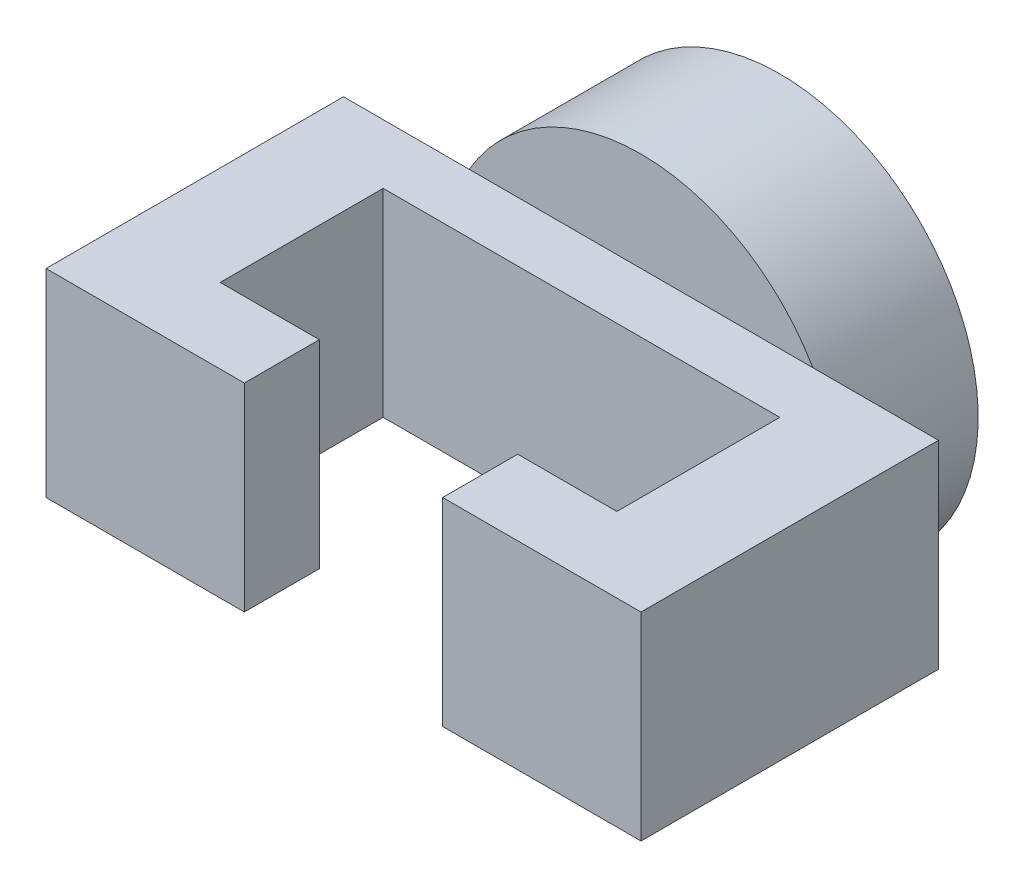
ISO-10303-21;
HEADER;
FILE_DESCRIPTION(('STEP AP214'),'2;1');
FILE_NAME('part.step','',(''),(''),'','','');
FILE_SCHEMA(('AUTOMOTIVE_DESIGN { 1 0 10303 214 1 1 1 1 }'));
ENDSEC;
DATA;
#1=APPLICATION_CONTEXT('core data for automotive mechanical design processes');
#2=APPLICATION_PROTOCOL_DEFINITION('international standard','automotive_design',2000,#1);
#3=PRODUCT_CONTEXT('',#1,'mechanical');
#4=PRODUCT('Part','Part','',(#3));
#5=PRODUCT_RELATED_PRODUCT_CATEGORY('part','',(#4));
#6=PRODUCT_DEFINITION_FORMATION('','',#4);
#7=PRODUCT_DEFINITION_CONTEXT('part definition',#1,'design');
#8=PRODUCT_DEFINITION('design','',#6,#7);
#9=PRODUCT_DEFINITION_SHAPE('','',#8);
#10=(LENGTH_UNIT() NAMED_UNIT(*) SI_UNIT(.MILLI.,.METRE.));
#11=(NAMED_UNIT(*) PLANE_ANGLE_UNIT() SI_UNIT($,.RADIAN.));
#12=(NAMED_UNIT(*) SI_UNIT($,.STERADIAN.) SOLID_ANGLE_UNIT());
#13=UNCERTAINTY_MEASURE_WITH_UNIT(LENGTH_MEASURE(1.E-05),#10,'distance_accuracy_value','');
#14=(GEOMETRIC_REPRESENTATION_CONTEXT(3) GLOBAL_UNCERTAINTY_ASSIGNED_CONTEXT((#13)) GLOBAL_UNIT_ASSIGNED_CONTEXT((#10,
#11,#12)) REPRESENTATION_CONTEXT('',''));
#15=CARTESIAN_POINT('',(0.,0.,0.));
#16=DIRECTION('',(0.,0.,1.));
#17=DIRECTION('',(1.,0.,0.));
#18=AXIS2_PLACEMENT_3D('',#15,#16,#17);
#19=CARTESIAN_POINT('',(0.,0.,200.));
#20=DIRECTION('',(0.,0.,1.));
#21=DIRECTION('',(1.,0.,0.));
#22=AXIS2_PLACEMENT_3D('',#19,#20,#21);
#23=PLANE('',#22);
#24=DIRECTION('',(0.,-1.,0.));
#25=VECTOR('',#24,1.);
#26=CARTESIAN_POINT('',(-50.,0.,200.));
#27=LINE('',#26,#25);
#28=CARTESIAN_POINT('',(-50.,50.,200.));
#29=VERTEX_POINT('',#28);
#30=CARTESIAN_POINT('',(-50.,-50.,200.));
#31=VERTEX_POINT('',#30);
#32=EDGE_CURVE('E11',#29,#31,#27,.T.);
#33=ORIENTED_EDGE('',*,*,#32,.F.);
#34=DIRECTION('',(-1.,0.,0.));
#35=VECTOR('',#34,1.);
#36=CARTESIAN_POINT('',(150.,50.,200.));
#37=LINE('',#36,#35);
#38=CARTESIAN_POINT('',(-150.,50.,200.));
#39=VERTEX_POINT('',#38);
#40=EDGE_CURVE('E205',#29,#39,#37,.T.);
#41=ORIENTED_EDGE('',*,*,#40,.T.);
#42=DIRECTION('',(0.,-1.,0.));
#43=VECTOR('',#42,1.);
#44=CARTESIAN_POINT('',(-150.,-50.,200.));
#45=LINE('',#44,#43);
#46=CARTESIAN_POINT('',(-150.,-50.,200.));
#47=VERTEX_POINT('',#46);
#48=EDGE_CURVE('E210',#39,#47,#45,.T.);
#49=ORIENTED_EDGE('',*,*,#48,.T.);
#50=DIRECTION('',(1.,0.,0.));
#51=VECTOR('',#50,1.);
#52=CARTESIAN_POINT('',(150.,-50.,200.));
#53=LINE('',#52,#51);
#54=EDGE_CURVE('E213',#47,#31,#53,.T.);
#55=ORIENTED_EDGE('',*,*,#54,.T.);
#56=EDGE_LOOP('',(#33,#41,#49,#55));
#57=FACE_BOUND('',#56,.T.);
#58=ADVANCED_FACE('F33',(#57),#23,.T.);
#59=CARTESIAN_POINT('',(0.,0.,50.));
#60=DIRECTION('',(0.,0.,1.));
#61=DIRECTION('',(1.,0.,0.));
#62=AXIS2_PLACEMENT_3D('',#59,#60,#61);
#63=PLANE('',#62);
#64=DIRECTION('',(1.,0.,0.));
#65=VECTOR('',#64,1.);
#66=CARTESIAN_POINT('',(150.,-50.,50.));
#67=LINE('',#66,#65);
#68=CARTESIAN_POINT('',(-86.6025403784439,-50.,50.));
#69=VERTEX_POINT('',#68);
#70=CARTESIAN_POINT('',(86.6025403784439,-50.,50.));
#71=VERTEX_POINT('',#70);
#72=EDGE_CURVE('E229',#69,#71,#67,.T.);
#73=ORIENTED_EDGE('',*,*,#72,.F.);
#74=CARTESIAN_POINT('',(0.,0.,50.));
#75=DIRECTION('',(0.,0.,1.));
#76=DIRECTION('',(1.,0.,0.));
#77=AXIS2_PLACEMENT_3D('',#74,#75,#76);
#78=CIRCLE('',#77,100.);
#79=EDGE_CURVE('E286',#69,#71,#78,.T.);
#80=ORIENTED_EDGE('',*,*,#79,.T.);
#81=EDGE_LOOP('',(#73,#80));
#82=FACE_BOUND('',#81,.T.);
#83=ADVANCED_FACE('F288',(#82),#63,.T.);
#84=CARTESIAN_POINT('',(0.,0.,50.));
#85=DIRECTION('',(0.,0.,-1.));
#86=DIRECTION('',(-1.,0.,0.));
#87=AXIS2_PLACEMENT_3D('',#84,#85,#86);
#88=CYLINDRICAL_SURFACE('',#87,100.);
#89=CARTESIAN_POINT('',(86.6025403784439,50.,50.));
#90=VERTEX_POINT('',#89);
#91=CARTESIAN_POINT('',(-86.6025403784439,50.,50.));
#92=VERTEX_POINT('',#91);
#93=EDGE_CURVE('E241',#90,#92,#78,.T.);
#94=ORIENTED_EDGE('',*,*,#93,.F.);
#95=EDGE_CURVE('E56',#71,#90,#78,.T.);
#96=ORIENTED_EDGE('',*,*,#95,.F.);
#97=ORIENTED_EDGE('',*,*,#79,.F.);
#98=EDGE_CURVE('E242',#92,#69,#78,.T.);
#99=ORIENTED_EDGE('',*,*,#98,.F.);
#100=EDGE_LOOP('',(#94,#96,#97,#99));
#101=FACE_BOUND('',#100,.T.);
#102=CARTESIAN_POINT('',(0.,0.,-20.));
#103=DIRECTION('',(0.,0.,-1.));
#104=DIRECTION('',(-1.,0.,0.));
#105=AXIS2_PLACEMENT_3D('',#102,#103,#104);
#106=CIRCLE('',#105,100.);
#107=CARTESIAN_POINT('',(-100.,0.,-20.));
#108=VERTEX_POINT('',#107);
#109=EDGE_CURVE('E157',#108,#108,#106,.T.);
#110=ORIENTED_EDGE('',*,*,#109,.F.);
#111=EDGE_LOOP('',(#110));
#112=FACE_BOUND('',#111,.T.);
#113=ADVANCED_FACE('F35',(#101,#112),#88,.T.);
#114=DIRECTION('',(-1.,0.,0.));
#115=VECTOR('',#114,1.);
#116=CARTESIAN_POINT('',(150.,50.,50.));
#117=LINE('',#116,#115);
#118=EDGE_CURVE('E224',#90,#92,#117,.T.);
#119=ORIENTED_EDGE('',*,*,#118,.F.);
#120=ORIENTED_EDGE('',*,*,#93,.T.);
#121=EDGE_LOOP('',(#119,#120));
#122=FACE_BOUND('',#121,.T.);
#123=ADVANCED_FACE('F291',(#122),#63,.T.);
#124=CARTESIAN_POINT('',(0.,0.,50.));
#125=DIRECTION('',(0.,0.,1.));
#126=DIRECTION('',(1.,0.,0.));
#127=AXIS2_PLACEMENT_3D('',#124,#125,#126);
#128=PLANE('',#127);
#129=CARTESIAN_POINT('',(-150.,50.,50.));
#130=VERTEX_POINT('',#129);
#131=EDGE_CURVE('E219',#92,#130,#117,.T.);
#132=ORIENTED_EDGE('',*,*,#131,.F.);
#133=ORIENTED_EDGE('',*,*,#98,.T.);
#134=CARTESIAN_POINT('',(-150.,-50.,50.));
#135=VERTEX_POINT('',#134);
#136=EDGE_CURVE('E206',#135,#69,#67,.T.);
#137=ORIENTED_EDGE('',*,*,#136,.F.);
#138=DIRECTION('',(0.,-1.,0.));
#139=VECTOR('',#138,1.);
#140=CARTESIAN_POINT('',(-150.,-50.,50.));
#141=LINE('',#140,#139);
#142=EDGE_CURVE('E223',#130,#135,#141,.T.);
#143=ORIENTED_EDGE('',*,*,#142,.F.);
#144=EDGE_LOOP('',(#132,#133,#137,#143));
#145=FACE_BOUND('',#144,.T.);
#146=ADVANCED_FACE('F284',(#145),#128,.F.);
#147=CARTESIAN_POINT('',(150.,-50.,50.));
#148=VERTEX_POINT('',#147);
#149=EDGE_CURVE('E226',#71,#148,#67,.T.);
#150=ORIENTED_EDGE('',*,*,#149,.F.);
#151=ORIENTED_EDGE('',*,*,#95,.T.);
#152=CARTESIAN_POINT('',(150.,50.,50.));
#153=VERTEX_POINT('',#152);
#154=EDGE_CURVE('E220',#153,#90,#117,.T.);
#155=ORIENTED_EDGE('',*,*,#154,.F.);
#156=DIRECTION('',(0.,1.,0.));
#157=VECTOR('',#156,1.);
#158=CARTESIAN_POINT('',(150.,-50.,50.));
#159=LINE('',#158,#157);
#160=EDGE_CURVE('E201',#148,#153,#159,.T.);
#161=ORIENTED_EDGE('',*,*,#160,.F.);
#162=EDGE_LOOP('',(#150,#151,#155,#161));
#163=FACE_BOUND('',#162,.T.);
#164=ADVANCED_FACE('F254',(#163),#128,.F.);
#165=CARTESIAN_POINT('',(150.,-50.,200.));
#166=DIRECTION('',(-1.,0.,0.));
#167=DIRECTION('',(0.,0.,1.));
#168=AXIS2_PLACEMENT_3D('',#165,#166,#167);
#169=PLANE('',#168);
#170=ORIENTED_EDGE('',*,*,#160,.T.);
#171=DIRECTION('',(0.,0.,-1.));
#172=VECTOR('',#171,1.);
#173=CARTESIAN_POINT('',(150.,50.,200.));
#174=LINE('',#173,#172);
#175=CARTESIAN_POINT('',(150.,50.,200.));
#176=VERTEX_POINT('',#175);
#177=EDGE_CURVE('E238',#176,#153,#174,.T.);
#178=ORIENTED_EDGE('',*,*,#177,.F.);
#179=DIRECTION('',(0.,1.,0.));
#180=VECTOR('',#179,1.);
#181=CARTESIAN_POINT('',(150.,-50.,200.));
#182=LINE('',#181,#180);
#183=CARTESIAN_POINT('',(150.,-50.,200.));
#184=VERTEX_POINT('',#183);
#185=EDGE_CURVE('E202',#184,#176,#182,.T.);
#186=ORIENTED_EDGE('',*,*,#185,.F.);
#187=DIRECTION('',(0.,0.,-1.));
#188=VECTOR('',#187,1.);
#189=CARTESIAN_POINT('',(150.,-50.,200.));
#190=LINE('',#189,#188);
#191=EDGE_CURVE('E216',#184,#148,#190,.T.);
#192=ORIENTED_EDGE('',*,*,#191,.T.);
#193=EDGE_LOOP('',(#170,#178,#186,#192));
#194=FACE_BOUND('',#193,.T.);
#195=ADVANCED_FACE('F252',(#194),#169,.F.);
#196=CARTESIAN_POINT('',(150.,50.,200.));
#197=DIRECTION('',(0.,-1.,0.));
#198=DIRECTION('',(1.,0.,0.));
#199=AXIS2_PLACEMENT_3D('',#196,#197,#198);
#200=PLANE('',#199);
#201=ORIENTED_EDGE('',*,*,#40,.F.);
#202=DIRECTION('',(0.,0.,-1.));
#203=VECTOR('',#202,1.);
#204=CARTESIAN_POINT('',(-50.,50.,200.));
#205=LINE('',#204,#203);
#206=CARTESIAN_POINT('',(-50.,50.,162.170416566633));
#207=VERTEX_POINT('',#206);
#208=EDGE_CURVE('E186',#29,#207,#205,.T.);
#209=ORIENTED_EDGE('',*,*,#208,.T.);
#210=DIRECTION('',(-1.,0.,0.));
#211=VECTOR('',#210,1.);
#212=CARTESIAN_POINT('',(150.,50.,162.170416566633));
#213=LINE('',#212,#211);
#214=CARTESIAN_POINT('',(-100.,50.,162.170416566633));
#215=VERTEX_POINT('',#214);
#216=EDGE_CURVE('E196',#207,#215,#213,.T.);
#217=ORIENTED_EDGE('',*,*,#216,.T.);
#218=DIRECTION('',(0.,0.,-1.));
#219=VECTOR('',#218,1.);
#220=CARTESIAN_POINT('',(-100.,50.,200.));
#221=LINE('',#220,#219);
#222=CARTESIAN_POINT('',(-99.9999999999999,50.,80.));
#223=VERTEX_POINT('',#222);
#224=EDGE_CURVE('E199',#215,#223,#221,.T.);
#225=ORIENTED_EDGE('',*,*,#224,.T.);
#226=DIRECTION('',(1.,0.,0.));
#227=VECTOR('',#226,1.);
#228=CARTESIAN_POINT('',(150.,50.,80.));
#229=LINE('',#228,#227);
#230=CARTESIAN_POINT('',(100.,50.,80.));
#231=VERTEX_POINT('',#230);
#232=EDGE_CURVE('E143',#223,#231,#229,.T.);
#233=ORIENTED_EDGE('',*,*,#232,.T.);
#234=DIRECTION('',(0.,0.,1.));
#235=VECTOR('',#234,1.);
#236=CARTESIAN_POINT('',(100.,50.,200.));
#237=LINE('',#236,#235);
#238=CARTESIAN_POINT('',(100.,50.,162.170416566633));
#239=VERTEX_POINT('',#238);
#240=EDGE_CURVE('E190',#231,#239,#237,.T.);
#241=ORIENTED_EDGE('',*,*,#240,.T.);
#242=DIRECTION('',(-1.,0.,0.));
#243=VECTOR('',#242,1.);
#244=CARTESIAN_POINT('',(150.,50.,162.170416566633));
#245=LINE('',#244,#243);
#246=CARTESIAN_POINT('',(50.,50.,162.170416566633));
#247=VERTEX_POINT('',#246);
#248=EDGE_CURVE('E193',#239,#247,#245,.T.);
#249=ORIENTED_EDGE('',*,*,#248,.T.);
#250=DIRECTION('',(0.,0.,1.));
#251=VECTOR('',#250,1.);
#252=CARTESIAN_POINT('',(50.,50.,200.));
#253=LINE('',#252,#251);
#254=CARTESIAN_POINT('',(50.,50.,200.));
#255=VERTEX_POINT('',#254);
#256=EDGE_CURVE('E176',#247,#255,#253,.T.);
#257=ORIENTED_EDGE('',*,*,#256,.T.);
#258=EDGE_CURVE('E207',#176,#255,#37,.T.);
#259=ORIENTED_EDGE('',*,*,#258,.F.);
#260=ORIENTED_EDGE('',*,*,#177,.T.);
#261=ORIENTED_EDGE('',*,*,#154,.T.);
#262=ORIENTED_EDGE('',*,*,#118,.T.);
#263=ORIENTED_EDGE('',*,*,#131,.T.);
#264=DIRECTION('',(0.,0.,-1.));
#265=VECTOR('',#264,1.);
#266=CARTESIAN_POINT('',(-150.,50.,200.));
#267=LINE('',#266,#265);
#268=EDGE_CURVE('E235',#39,#130,#267,.T.);
#269=ORIENTED_EDGE('',*,*,#268,.F.);
#270=EDGE_LOOP('',(#201,#209,#217,#225,#233,#241,#249,#257,#259,#260,#261,#262,#263,#269));
#271=FACE_BOUND('',#270,.T.);
#272=ADVANCED_FACE('F257',(#271),#200,.F.);
#273=CARTESIAN_POINT('',(-150.,-50.,200.));
#274=DIRECTION('',(1.,0.,0.));
#275=DIRECTION('',(0.,0.,-1.));
#276=AXIS2_PLACEMENT_3D('',#273,#274,#275);
#277=PLANE('',#276);
#278=ORIENTED_EDGE('',*,*,#142,.T.);
#279=DIRECTION('',(0.,0.,-1.));
#280=VECTOR('',#279,1.);
#281=CARTESIAN_POINT('',(-150.,-50.,200.));
#282=LINE('',#281,#280);
#283=EDGE_CURVE('E232',#47,#135,#282,.T.);
#284=ORIENTED_EDGE('',*,*,#283,.F.);
#285=ORIENTED_EDGE('',*,*,#48,.F.);
#286=ORIENTED_EDGE('',*,*,#268,.T.);
#287=EDGE_LOOP('',(#278,#284,#285,#286));
#288=FACE_BOUND('',#287,.T.);
#289=ADVANCED_FACE('F278',(#288),#277,.F.);
#290=CARTESIAN_POINT('',(150.,-50.,200.));
#291=DIRECTION('',(0.,1.,0.));
#292=DIRECTION('',(-1.,0.,0.));
#293=AXIS2_PLACEMENT_3D('',#290,#291,#292);
#294=PLANE('',#293);
#295=DIRECTION('',(-1.,0.,0.));
#296=VECTOR('',#295,1.);
#297=CARTESIAN_POINT('',(-99.9999999999999,-50.,162.170416566633));
#298=LINE('',#297,#296);
#299=CARTESIAN_POINT('',(-50.,-50.,162.170416566633));
#300=VERTEX_POINT('',#299);
#301=CARTESIAN_POINT('',(-99.9999999999999,-50.,162.170416566633));
#302=VERTEX_POINT('',#301);
#303=EDGE_CURVE('E147',#300,#302,#298,.T.);
#304=ORIENTED_EDGE('',*,*,#303,.F.);
#305=DIRECTION('',(0.,0.,-1.));
#306=VECTOR('',#305,1.);
#307=CARTESIAN_POINT('',(-50.,-50.,200.));
#308=LINE('',#307,#306);
#309=EDGE_CURVE('E171',#31,#300,#308,.T.);
#310=ORIENTED_EDGE('',*,*,#309,.F.);
#311=ORIENTED_EDGE('',*,*,#54,.F.);
#312=ORIENTED_EDGE('',*,*,#283,.T.);
#313=ORIENTED_EDGE('',*,*,#136,.T.);
#314=ORIENTED_EDGE('',*,*,#72,.T.);
#315=ORIENTED_EDGE('',*,*,#149,.T.);
#316=ORIENTED_EDGE('',*,*,#191,.F.);
#317=CARTESIAN_POINT('',(50.,-50.,200.));
#318=VERTEX_POINT('',#317);
#319=EDGE_CURVE('E212',#318,#184,#53,.T.);
#320=ORIENTED_EDGE('',*,*,#319,.F.);
#321=DIRECTION('',(0.,0.,1.));
#322=VECTOR('',#321,1.);
#323=CARTESIAN_POINT('',(50.,-50.,200.));
#324=LINE('',#323,#322);
#325=CARTESIAN_POINT('',(50.,-50.,162.170416566633));
#326=VERTEX_POINT('',#325);
#327=EDGE_CURVE('E48',#326,#318,#324,.T.);
#328=ORIENTED_EDGE('',*,*,#327,.F.);
#329=DIRECTION('',(-1.,0.,0.));
#330=VECTOR('',#329,1.);
#331=CARTESIAN_POINT('',(50.,-50.,162.170416566633));
#332=LINE('',#331,#330);
#333=CARTESIAN_POINT('',(100.,-50.,162.170416566633));
#334=VERTEX_POINT('',#333);
#335=EDGE_CURVE('E164',#334,#326,#332,.T.);
#336=ORIENTED_EDGE('',*,*,#335,.F.);
#337=DIRECTION('',(0.,0.,1.));
#338=VECTOR('',#337,1.);
#339=CARTESIAN_POINT('',(100.,-50.,162.170416566633));
#340=LINE('',#339,#338);
#341=CARTESIAN_POINT('',(100.,-50.,80.));
#342=VERTEX_POINT('',#341);
#343=EDGE_CURVE('E162',#342,#334,#340,.T.);
#344=ORIENTED_EDGE('',*,*,#343,.F.);
#345=DIRECTION('',(1.,0.,0.));
#346=VECTOR('',#345,1.);
#347=CARTESIAN_POINT('',(-99.9999999999999,-50.,80.));
#348=LINE('',#347,#346);
#349=CARTESIAN_POINT('',(-99.9999999999999,-50.,80.));
#350=VERTEX_POINT('',#349);
#351=EDGE_CURVE('E140',#350,#342,#348,.T.);
#352=ORIENTED_EDGE('',*,*,#351,.F.);
#353=DIRECTION('',(0.,0.,-1.));
#354=VECTOR('',#353,1.);
#355=CARTESIAN_POINT('',(-99.9999999999999,-50.,162.170416566633));
#356=LINE('',#355,#354);
#357=EDGE_CURVE('E150',#302,#350,#356,.T.);
#358=ORIENTED_EDGE('',*,*,#357,.F.);
#359=EDGE_LOOP('',(#304,#310,#311,#312,#313,#314,#315,#316,#320,#328,#336,#344,#352,#358));
#360=FACE_BOUND('',#359,.T.);
#361=ADVANCED_FACE('F159',(#360),#294,.F.);
#362=DIRECTION('',(0.,1.,0.));
#363=VECTOR('',#362,1.);
#364=CARTESIAN_POINT('',(50.,0.,200.));
#365=LINE('',#364,#363);
#366=EDGE_CURVE('E41',#318,#255,#365,.T.);
#367=ORIENTED_EDGE('',*,*,#366,.F.);
#368=ORIENTED_EDGE('',*,*,#319,.T.);
#369=ORIENTED_EDGE('',*,*,#185,.T.);
#370=ORIENTED_EDGE('',*,*,#258,.T.);
#371=EDGE_LOOP('',(#367,#368,#369,#370));
#372=FACE_BOUND('',#371,.T.);
#373=ADVANCED_FACE('F259',(#372),#23,.T.);
#374=CARTESIAN_POINT('',(-100.,100.,162.170416566633));
#375=DIRECTION('',(-1.,0.,0.));
#376=DIRECTION('',(0.,0.,1.));
#377=AXIS2_PLACEMENT_3D('',#374,#375,#376);
#378=PLANE('',#377);
#379=DIRECTION('',(0.,-1.,0.));
#380=VECTOR('',#379,1.);
#381=CARTESIAN_POINT('',(-100.,100.,162.170416566633));
#382=LINE('',#381,#380);
#383=EDGE_CURVE('E153',#215,#302,#382,.T.);
#384=ORIENTED_EDGE('',*,*,#383,.T.);
#385=ORIENTED_EDGE('',*,*,#357,.T.);
#386=DIRECTION('',(0.,-1.,0.));
#387=VECTOR('',#386,1.);
#388=CARTESIAN_POINT('',(-100.,100.,80.));
#389=LINE('',#388,#387);
#390=EDGE_CURVE('E135',#223,#350,#389,.T.);
#391=ORIENTED_EDGE('',*,*,#390,.F.);
#392=ORIENTED_EDGE('',*,*,#224,.F.);
#393=EDGE_LOOP('',(#384,#385,#391,#392));
#394=FACE_BOUND('',#393,.T.);
#395=ADVANCED_FACE('F151',(#394),#378,.F.);
#396=CARTESIAN_POINT('',(-100.,100.,162.170416566633));
#397=DIRECTION('',(0.,0.,1.));
#398=DIRECTION('',(1.,0.,0.));
#399=AXIS2_PLACEMENT_3D('',#396,#397,#398);
#400=PLANE('',#399);
#401=DIRECTION('',(0.,-1.,0.));
#402=VECTOR('',#401,1.);
#403=CARTESIAN_POINT('',(-50.,100.,162.170416566633));
#404=LINE('',#403,#402);
#405=EDGE_CURVE('E177',#207,#300,#404,.T.);
#406=ORIENTED_EDGE('',*,*,#405,.T.);
#407=ORIENTED_EDGE('',*,*,#303,.T.);
#408=ORIENTED_EDGE('',*,*,#383,.F.);
#409=ORIENTED_EDGE('',*,*,#216,.F.);
#410=EDGE_LOOP('',(#406,#407,#408,#409));
#411=FACE_BOUND('',#410,.T.);
#412=ADVANCED_FACE('F267',(#411),#400,.F.);
#413=CARTESIAN_POINT('',(50.,100.,162.170416566633));
#414=DIRECTION('',(0.,0.,1.));
#415=DIRECTION('',(1.,0.,0.));
#416=AXIS2_PLACEMENT_3D('',#413,#414,#415);
#417=PLANE('',#416);
#418=DIRECTION('',(0.,-1.,0.));
#419=VECTOR('',#418,1.);
#420=CARTESIAN_POINT('',(100.,100.,162.170416566633));
#421=LINE('',#420,#419);
#422=EDGE_CURVE('E181',#239,#334,#421,.T.);
#423=ORIENTED_EDGE('',*,*,#422,.T.);
#424=ORIENTED_EDGE('',*,*,#335,.T.);
#425=DIRECTION('',(0.,-1.,0.));
#426=VECTOR('',#425,1.);
#427=CARTESIAN_POINT('',(50.,100.,162.170416566633));
#428=LINE('',#427,#426);
#429=EDGE_CURVE('E179',#247,#326,#428,.T.);
#430=ORIENTED_EDGE('',*,*,#429,.F.);
#431=ORIENTED_EDGE('',*,*,#248,.F.);
#432=EDGE_LOOP('',(#423,#424,#430,#431));
#433=FACE_BOUND('',#432,.T.);
#434=ADVANCED_FACE('F262',(#433),#417,.F.);
#435=CARTESIAN_POINT('',(100.,100.,162.170416566633));
#436=DIRECTION('',(1.,0.,0.));
#437=DIRECTION('',(0.,0.,-1.));
#438=AXIS2_PLACEMENT_3D('',#435,#436,#437);
#439=PLANE('',#438);
#440=DIRECTION('',(0.,-1.,0.));
#441=VECTOR('',#440,1.);
#442=CARTESIAN_POINT('',(100.,100.,80.));
#443=LINE('',#442,#441);
#444=EDGE_CURVE('E146',#231,#342,#443,.T.);
#445=ORIENTED_EDGE('',*,*,#444,.T.);
#446=ORIENTED_EDGE('',*,*,#343,.T.);
#447=ORIENTED_EDGE('',*,*,#422,.F.);
#448=ORIENTED_EDGE('',*,*,#240,.F.);
#449=EDGE_LOOP('',(#445,#446,#447,#448));
#450=FACE_BOUND('',#449,.T.);
#451=ADVANCED_FACE('F265',(#450),#439,.F.);
#452=CARTESIAN_POINT('',(-100.,100.,80.));
#453=DIRECTION('',(0.,0.,-1.));
#454=DIRECTION('',(-1.,0.,0.));
#455=AXIS2_PLACEMENT_3D('',#452,#453,#454);
#456=PLANE('',#455);
#457=ORIENTED_EDGE('',*,*,#390,.T.);
#458=ORIENTED_EDGE('',*,*,#351,.T.);
#459=ORIENTED_EDGE('',*,*,#444,.F.);
#460=ORIENTED_EDGE('',*,*,#232,.F.);
#461=EDGE_LOOP('',(#457,#458,#459,#460));
#462=FACE_BOUND('',#461,.T.);
#463=ADVANCED_FACE('F137',(#462),#456,.F.);
#464=CARTESIAN_POINT('',(-50.,100.,200.));
#465=DIRECTION('',(-1.,0.,0.));
#466=DIRECTION('',(0.,0.,1.));
#467=AXIS2_PLACEMENT_3D('',#464,#465,#466);
#468=PLANE('',#467);
#469=ORIENTED_EDGE('',*,*,#32,.T.);
#470=ORIENTED_EDGE('',*,*,#309,.T.);
#471=ORIENTED_EDGE('',*,*,#405,.F.);
#472=ORIENTED_EDGE('',*,*,#208,.F.);
#473=EDGE_LOOP('',(#469,#470,#471,#472));
#474=FACE_BOUND('',#473,.T.);
#475=ADVANCED_FACE('F302',(#474),#468,.F.);
#476=CARTESIAN_POINT('',(50.,100.,200.));
#477=DIRECTION('',(1.,0.,0.));
#478=DIRECTION('',(0.,0.,-1.));
#479=AXIS2_PLACEMENT_3D('',#476,#477,#478);
#480=PLANE('',#479);
#481=ORIENTED_EDGE('',*,*,#429,.T.);
#482=ORIENTED_EDGE('',*,*,#327,.T.);
#483=ORIENTED_EDGE('',*,*,#366,.T.);
#484=ORIENTED_EDGE('',*,*,#256,.F.);
#485=EDGE_LOOP('',(#481,#482,#483,#484));
#486=FACE_BOUND('',#485,.T.);
#487=ADVANCED_FACE('F297',(#486),#480,.F.);
#488=CARTESIAN_POINT('',(0.,0.,-20.));
#489=DIRECTION('',(0.,0.,-1.));
#490=DIRECTION('',(-1.,0.,0.));
#491=AXIS2_PLACEMENT_3D('',#488,#489,#490);
#492=PLANE('',#491);
#493=ORIENTED_EDGE('',*,*,#109,.T.);
#494=EDGE_LOOP('',(#493));
#495=FACE_BOUND('',#494,.T.);
#496=ADVANCED_FACE('F295',(#495),#492,.T.);
#497=CLOSED_SHELL('',(#58,#83,#113,#123,#146,#164,#195,#272,#289,#361,#373,#395,#412,#434,#451,
#463,#475,#487,#496));
#498=MANIFOLD_SOLID_BREP('B2',#497);
#499=ADVANCED_BREP_SHAPE_REPRESENTATION('',(#18,#498),#14);
#500=SHAPE_DEFINITION_REPRESENTATION(#9,#499);
ENDSEC;
END-ISO-10303-21;
